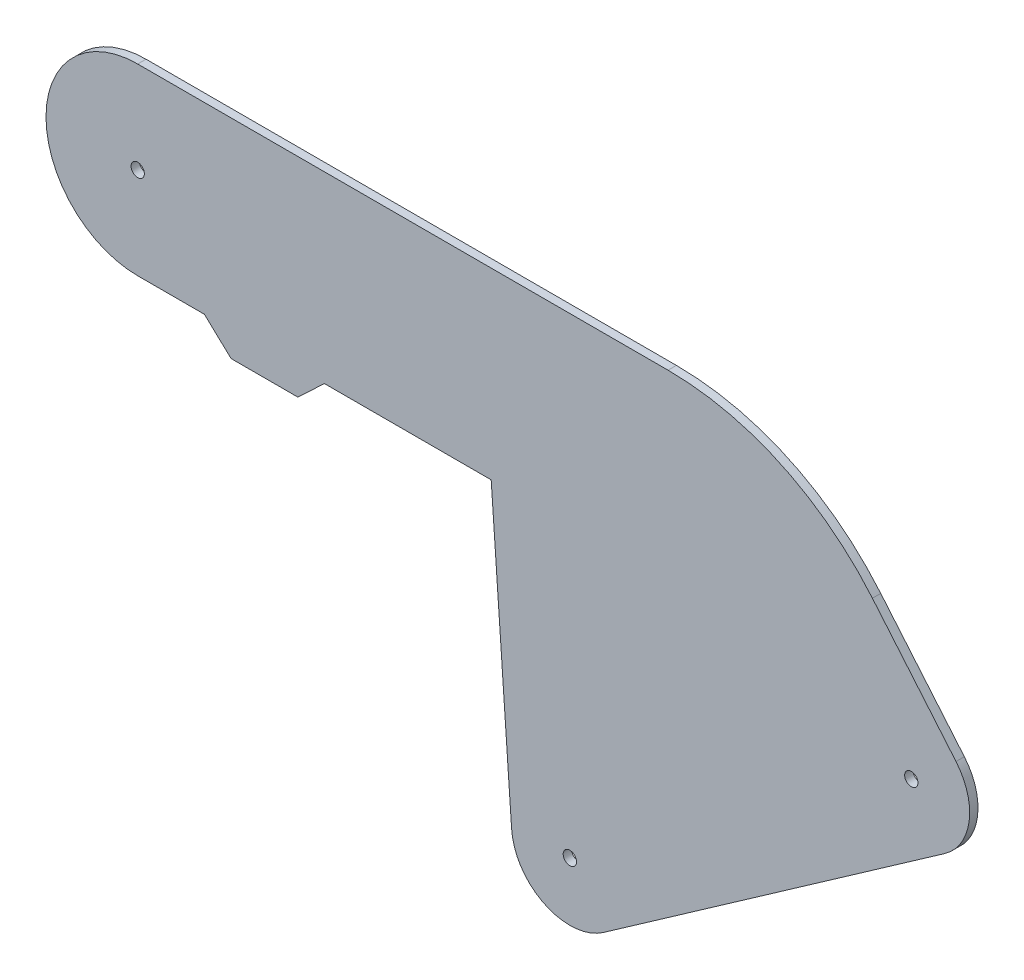
ISO-10303-21;
HEADER;
FILE_DESCRIPTION(('STEP AP214'),'2;1');
FILE_NAME('part.step','',(''),(''),'','','');
FILE_SCHEMA(('AUTOMOTIVE_DESIGN { 1 0 10303 214 1 1 1 1 }'));
ENDSEC;
DATA;
#1=APPLICATION_CONTEXT('core data for automotive mechanical design processes');
#2=APPLICATION_PROTOCOL_DEFINITION('international standard','automotive_design',2000,#1);
#3=PRODUCT_CONTEXT('',#1,'mechanical');
#4=PRODUCT('Part','Part','',(#3));
#5=PRODUCT_RELATED_PRODUCT_CATEGORY('part','',(#4));
#6=PRODUCT_DEFINITION_FORMATION('','',#4);
#7=PRODUCT_DEFINITION_CONTEXT('part definition',#1,'design');
#8=PRODUCT_DEFINITION('design','',#6,#7);
#9=PRODUCT_DEFINITION_SHAPE('','',#8);
#10=(LENGTH_UNIT() NAMED_UNIT(*) SI_UNIT(.MILLI.,.METRE.));
#11=(NAMED_UNIT(*) PLANE_ANGLE_UNIT() SI_UNIT($,.RADIAN.));
#12=(NAMED_UNIT(*) SI_UNIT($,.STERADIAN.) SOLID_ANGLE_UNIT());
#13=UNCERTAINTY_MEASURE_WITH_UNIT(LENGTH_MEASURE(1.E-05),#10,'distance_accuracy_value','');
#14=(GEOMETRIC_REPRESENTATION_CONTEXT(3) GLOBAL_UNCERTAINTY_ASSIGNED_CONTEXT((#13)) GLOBAL_UNIT_ASSIGNED_CONTEXT((#10,
#11,#12)) REPRESENTATION_CONTEXT('',''));
#15=CARTESIAN_POINT('',(0.,0.,0.));
#16=DIRECTION('',(0.,0.,1.));
#17=DIRECTION('',(1.,0.,0.));
#18=AXIS2_PLACEMENT_3D('',#15,#16,#17);
#19=CARTESIAN_POINT('',(164.572072720799,71.2488259804572,3.175));
#20=DIRECTION('',(0.,0.,1.));
#21=DIRECTION('',(1.,0.,0.));
#22=AXIS2_PLACEMENT_3D('',#19,#20,#21);
#23=PLANE('',#22);
#24=CARTESIAN_POINT('',(0.,215.9,3.175));
#25=DIRECTION('',(0.,0.,1.));
#26=DIRECTION('',(1.,0.,0.));
#27=AXIS2_PLACEMENT_3D('',#24,#25,#26);
#28=CIRCLE('',#27,2.54000000000001);
#29=CARTESIAN_POINT('',(2.54000000000001,215.9,3.175));
#30=VERTEX_POINT('',#29);
#31=EDGE_CURVE('E349',#30,#30,#28,.T.);
#32=ORIENTED_EDGE('',*,*,#31,.F.);
#33=EDGE_LOOP('',(#32));
#34=FACE_BOUND('',#33,.T.);
#35=CARTESIAN_POINT('',(164.572072720799,71.2488259804572,3.175));
#36=DIRECTION('',(0.,0.,1.));
#37=DIRECTION('',(1.,0.,0.));
#38=AXIS2_PLACEMENT_3D('',#35,#36,#37);
#39=CIRCLE('',#38,22.2249999999999);
#40=CARTESIAN_POINT('',(142.401211703775,69.6984883514941,3.175));
#41=VERTEX_POINT('',#40);
#42=CARTESIAN_POINT('',(177.319809018701,53.0431717961344,3.175));
#43=VERTEX_POINT('',#42);
#44=EDGE_CURVE('E215',#41,#43,#39,.T.);
#45=ORIENTED_EDGE('',*,*,#44,.T.);
#46=DIRECTION('',(0.819152044288991,0.573576436351047,0.));
#47=VECTOR('',#46,1.);
#48=CARTESIAN_POINT('',(177.319809018701,53.0431717961344,3.175));
#49=LINE('',#48,#47);
#50=CARTESIAN_POINT('',(307.360196049579,144.098431066863,3.175));
#51=VERTEX_POINT('',#50);
#52=EDGE_CURVE('E121',#43,#51,#49,.T.);
#53=ORIENTED_EDGE('',*,*,#52,.T.);
#54=CARTESIAN_POINT('',(294.612459751677,162.304085251186,3.175));
#55=DIRECTION('',(0.,0.,1.));
#56=DIRECTION('',(-1.,0.,0.));
#57=AXIS2_PLACEMENT_3D('',#54,#55,#56);
#58=CIRCLE('',#57,22.225);
#59=CARTESIAN_POINT('',(311.637797499996,176.590039876469,3.175));
#60=VERTEX_POINT('',#59);
#61=EDGE_CURVE('E256',#51,#60,#58,.T.);
#62=ORIENTED_EDGE('',*,*,#61,.T.);
#63=DIRECTION('',(-0.642787609686537,0.76604444311898,0.));
#64=VECTOR('',#63,1.);
#65=CARTESIAN_POINT('',(279.800527192222,214.532221144152,3.175));
#66=LINE('',#65,#64);
#67=CARTESIAN_POINT('',(279.800527192222,214.532221144152,3.175));
#68=VERTEX_POINT('',#67);
#69=EDGE_CURVE('E276',#60,#68,#66,.T.);
#70=ORIENTED_EDGE('',*,*,#69,.T.);
#71=CARTESIAN_POINT('',(201.970411771333,149.225,3.175));
#72=DIRECTION('',(0.,0.,1.));
#73=DIRECTION('',(-1.,0.,0.));
#74=AXIS2_PLACEMENT_3D('',#71,#72,#73);
#75=CIRCLE('',#74,101.6);
#76=CARTESIAN_POINT('',(201.970411771333,250.825,3.175));
#77=VERTEX_POINT('',#76);
#78=EDGE_CURVE('E272',#68,#77,#75,.T.);
#79=ORIENTED_EDGE('',*,*,#78,.T.);
#80=DIRECTION('',(-1.,0.,0.));
#81=VECTOR('',#80,1.);
#82=CARTESIAN_POINT('',(0.,250.825,3.175));
#83=LINE('',#82,#81);
#84=CARTESIAN_POINT('',(0.,250.825,3.175));
#85=VERTEX_POINT('',#84);
#86=EDGE_CURVE('E275',#77,#85,#83,.T.);
#87=ORIENTED_EDGE('',*,*,#86,.T.);
#88=CARTESIAN_POINT('',(0.,215.9,3.175));
#89=DIRECTION('',(0.,0.,1.));
#90=DIRECTION('',(1.,0.,0.));
#91=AXIS2_PLACEMENT_3D('',#88,#89,#90);
#92=CIRCLE('',#91,34.925);
#93=CARTESIAN_POINT('',(0.,180.975,3.175));
#94=VERTEX_POINT('',#93);
#95=EDGE_CURVE('E280',#85,#94,#92,.T.);
#96=ORIENTED_EDGE('',*,*,#95,.T.);
#97=DIRECTION('',(1.,0.,0.));
#98=VECTOR('',#97,1.);
#99=CARTESIAN_POINT('',(0.,180.975,3.175));
#100=LINE('',#99,#98);
#101=CARTESIAN_POINT('',(25.4,180.975,3.175));
#102=VERTEX_POINT('',#101);
#103=EDGE_CURVE('E287',#94,#102,#100,.T.);
#104=ORIENTED_EDGE('',*,*,#103,.T.);
#105=DIRECTION('',(0.729537204140084,-0.683941128881331,0.));
#106=VECTOR('',#105,1.);
#107=CARTESIAN_POINT('',(25.4,180.975,3.175));
#108=LINE('',#107,#106);
#109=CARTESIAN_POINT('',(35.56,171.45,3.175));
#110=VERTEX_POINT('',#109);
#111=EDGE_CURVE('E290',#102,#110,#108,.T.);
#112=ORIENTED_EDGE('',*,*,#111,.T.);
#113=DIRECTION('',(1.,0.,0.));
#114=VECTOR('',#113,1.);
#115=CARTESIAN_POINT('',(35.56,171.45,3.175));
#116=LINE('',#115,#114);
#117=CARTESIAN_POINT('',(60.96,171.45,3.175));
#118=VERTEX_POINT('',#117);
#119=EDGE_CURVE('E155',#110,#118,#116,.T.);
#120=ORIENTED_EDGE('',*,*,#119,.T.);
#121=DIRECTION('',(0.729537204140085,0.68394112888133,0.));
#122=VECTOR('',#121,1.);
#123=CARTESIAN_POINT('',(60.96,171.45,3.175));
#124=LINE('',#123,#122);
#125=CARTESIAN_POINT('',(71.12,180.975,3.175));
#126=VERTEX_POINT('',#125);
#127=EDGE_CURVE('E149',#118,#126,#124,.T.);
#128=ORIENTED_EDGE('',*,*,#127,.T.);
#129=DIRECTION('',(1.,0.,0.));
#130=VECTOR('',#129,1.);
#131=CARTESIAN_POINT('',(71.12,180.975,3.175));
#132=LINE('',#131,#130);
#133=CARTESIAN_POINT('',(134.62,180.975,3.175));
#134=VERTEX_POINT('',#133);
#135=EDGE_CURVE('E153',#126,#134,#132,.T.);
#136=ORIENTED_EDGE('',*,*,#135,.T.);
#137=DIRECTION('',(0.069756473744122,-0.997564050259824,0.));
#138=VECTOR('',#137,1.);
#139=CARTESIAN_POINT('',(134.62,180.975,3.175));
#140=LINE('',#139,#138);
#141=EDGE_CURVE('E63',#134,#41,#140,.T.);
#142=ORIENTED_EDGE('',*,*,#141,.T.);
#143=EDGE_LOOP('',(#45,#53,#62,#70,#79,#87,#96,#104,#112,#120,#128,#136,#142));
#144=FACE_BOUND('',#143,.T.);
#145=CARTESIAN_POINT('',(164.572072720799,71.2488259804572,3.175));
#146=DIRECTION('',(0.,0.,1.));
#147=DIRECTION('',(1.,0.,0.));
#148=AXIS2_PLACEMENT_3D('',#145,#146,#147);
#149=CIRCLE('',#148,2.5400000000398);
#150=CARTESIAN_POINT('',(167.112072720839,71.2488259804572,3.175));
#151=VERTEX_POINT('',#150);
#152=EDGE_CURVE('E182',#151,#151,#149,.T.);
#153=ORIENTED_EDGE('',*,*,#152,.F.);
#154=EDGE_LOOP('',(#153));
#155=FACE_BOUND('',#154,.T.);
#156=CARTESIAN_POINT('',(294.612459751677,162.304085251186,3.175));
#157=DIRECTION('',(0.,0.,1.));
#158=DIRECTION('',(1.,0.,0.));
#159=AXIS2_PLACEMENT_3D('',#156,#157,#158);
#160=CIRCLE('',#159,2.54000000000186);
#161=CARTESIAN_POINT('',(297.152459751678,162.304085251186,3.175));
#162=VERTEX_POINT('',#161);
#163=EDGE_CURVE('E338',#162,#162,#160,.T.);
#164=ORIENTED_EDGE('',*,*,#163,.F.);
#165=EDGE_LOOP('',(#164));
#166=FACE_BOUND('',#165,.T.);
#167=ADVANCED_FACE('F45',(#34,#144,#155,#166),#23,.T.);
#168=CARTESIAN_POINT('',(164.572072720799,71.2488259804572,0.));
#169=DIRECTION('',(0.,0.,1.));
#170=DIRECTION('',(1.,0.,0.));
#171=AXIS2_PLACEMENT_3D('',#168,#169,#170);
#172=PLANE('',#171);
#173=CARTESIAN_POINT('',(164.572072720799,71.2488259804572,0.));
#174=DIRECTION('',(0.,0.,1.));
#175=DIRECTION('',(1.,0.,0.));
#176=AXIS2_PLACEMENT_3D('',#173,#174,#175);
#177=CIRCLE('',#176,22.2249999999999);
#178=CARTESIAN_POINT('',(142.401211703775,69.6984883514941,0.));
#179=VERTEX_POINT('',#178);
#180=CARTESIAN_POINT('',(177.319809018701,53.0431717961344,0.));
#181=VERTEX_POINT('',#180);
#182=EDGE_CURVE('E177',#179,#181,#177,.T.);
#183=ORIENTED_EDGE('',*,*,#182,.F.);
#184=DIRECTION('',(0.069756473744122,-0.997564050259824,0.));
#185=VECTOR('',#184,1.);
#186=CARTESIAN_POINT('',(134.62,180.975,0.));
#187=LINE('',#186,#185);
#188=CARTESIAN_POINT('',(134.62,180.975,0.));
#189=VERTEX_POINT('',#188);
#190=EDGE_CURVE('E113',#189,#179,#187,.T.);
#191=ORIENTED_EDGE('',*,*,#190,.F.);
#192=DIRECTION('',(1.,0.,0.));
#193=VECTOR('',#192,1.);
#194=CARTESIAN_POINT('',(71.12,180.975,0.));
#195=LINE('',#194,#193);
#196=CARTESIAN_POINT('',(71.12,180.975,0.));
#197=VERTEX_POINT('',#196);
#198=EDGE_CURVE('E107',#197,#189,#195,.T.);
#199=ORIENTED_EDGE('',*,*,#198,.F.);
#200=DIRECTION('',(0.729537204140085,0.68394112888133,0.));
#201=VECTOR('',#200,1.);
#202=CARTESIAN_POINT('',(60.96,171.45,0.));
#203=LINE('',#202,#201);
#204=CARTESIAN_POINT('',(60.96,171.45,0.));
#205=VERTEX_POINT('',#204);
#206=EDGE_CURVE('E164',#205,#197,#203,.T.);
#207=ORIENTED_EDGE('',*,*,#206,.F.);
#208=DIRECTION('',(1.,0.,0.));
#209=VECTOR('',#208,1.);
#210=CARTESIAN_POINT('',(35.56,171.45,0.));
#211=LINE('',#210,#209);
#212=CARTESIAN_POINT('',(35.56,171.45,0.));
#213=VERTEX_POINT('',#212);
#214=EDGE_CURVE('E206',#213,#205,#211,.T.);
#215=ORIENTED_EDGE('',*,*,#214,.F.);
#216=DIRECTION('',(0.729537204140084,-0.683941128881331,0.));
#217=VECTOR('',#216,1.);
#218=CARTESIAN_POINT('',(25.4,180.975,0.));
#219=LINE('',#218,#217);
#220=CARTESIAN_POINT('',(25.4,180.975,0.));
#221=VERTEX_POINT('',#220);
#222=EDGE_CURVE('E203',#221,#213,#219,.T.);
#223=ORIENTED_EDGE('',*,*,#222,.F.);
#224=DIRECTION('',(1.,0.,0.));
#225=VECTOR('',#224,1.);
#226=CARTESIAN_POINT('',(0.,180.975,0.));
#227=LINE('',#226,#225);
#228=CARTESIAN_POINT('',(0.,180.975,0.));
#229=VERTEX_POINT('',#228);
#230=EDGE_CURVE('E200',#229,#221,#227,.T.);
#231=ORIENTED_EDGE('',*,*,#230,.F.);
#232=CARTESIAN_POINT('',(0.,215.9,0.));
#233=DIRECTION('',(0.,0.,1.));
#234=DIRECTION('',(1.,0.,0.));
#235=AXIS2_PLACEMENT_3D('',#232,#233,#234);
#236=CIRCLE('',#235,34.925);
#237=CARTESIAN_POINT('',(0.,250.825,0.));
#238=VERTEX_POINT('',#237);
#239=EDGE_CURVE('E197',#238,#229,#236,.T.);
#240=ORIENTED_EDGE('',*,*,#239,.F.);
#241=DIRECTION('',(-1.,0.,0.));
#242=VECTOR('',#241,1.);
#243=CARTESIAN_POINT('',(0.,250.825,0.));
#244=LINE('',#243,#242);
#245=CARTESIAN_POINT('',(201.970411771333,250.825,0.));
#246=VERTEX_POINT('',#245);
#247=EDGE_CURVE('E194',#246,#238,#244,.T.);
#248=ORIENTED_EDGE('',*,*,#247,.F.);
#249=CARTESIAN_POINT('',(201.970411771333,149.225,0.));
#250=DIRECTION('',(0.,0.,1.));
#251=DIRECTION('',(-1.,0.,0.));
#252=AXIS2_PLACEMENT_3D('',#249,#250,#251);
#253=CIRCLE('',#252,101.6);
#254=CARTESIAN_POINT('',(279.800527192222,214.532221144152,0.));
#255=VERTEX_POINT('',#254);
#256=EDGE_CURVE('E191',#255,#246,#253,.T.);
#257=ORIENTED_EDGE('',*,*,#256,.F.);
#258=DIRECTION('',(-0.642787609686537,0.76604444311898,0.));
#259=VECTOR('',#258,1.);
#260=CARTESIAN_POINT('',(279.800527192222,214.532221144152,0.));
#261=LINE('',#260,#259);
#262=CARTESIAN_POINT('',(311.637797499996,176.590039876469,0.));
#263=VERTEX_POINT('',#262);
#264=EDGE_CURVE('E188',#263,#255,#261,.T.);
#265=ORIENTED_EDGE('',*,*,#264,.F.);
#266=CARTESIAN_POINT('',(294.612459751677,162.304085251186,0.));
#267=DIRECTION('',(0.,0.,1.));
#268=DIRECTION('',(-1.,0.,0.));
#269=AXIS2_PLACEMENT_3D('',#266,#267,#268);
#270=CIRCLE('',#269,22.225);
#271=CARTESIAN_POINT('',(307.360196049579,144.098431066863,0.));
#272=VERTEX_POINT('',#271);
#273=EDGE_CURVE('E185',#272,#263,#270,.T.);
#274=ORIENTED_EDGE('',*,*,#273,.F.);
#275=DIRECTION('',(0.819152044288991,0.573576436351047,0.));
#276=VECTOR('',#275,1.);
#277=CARTESIAN_POINT('',(177.319809018701,53.0431717961344,0.));
#278=LINE('',#277,#276);
#279=EDGE_CURVE('E181',#181,#272,#278,.T.);
#280=ORIENTED_EDGE('',*,*,#279,.F.);
#281=EDGE_LOOP('',(#183,#191,#199,#207,#215,#223,#231,#240,#248,#257,#265,#274,#280));
#282=FACE_BOUND('',#281,.T.);
#283=CARTESIAN_POINT('',(164.572072720799,71.2488259804572,0.));
#284=DIRECTION('',(0.,0.,1.));
#285=DIRECTION('',(1.,0.,0.));
#286=AXIS2_PLACEMENT_3D('',#283,#284,#285);
#287=CIRCLE('',#286,2.5400000000398);
#288=CARTESIAN_POINT('',(167.112072720839,71.2488259804572,0.));
#289=VERTEX_POINT('',#288);
#290=EDGE_CURVE('E353',#289,#289,#287,.T.);
#291=ORIENTED_EDGE('',*,*,#290,.T.);
#292=EDGE_LOOP('',(#291));
#293=FACE_BOUND('',#292,.T.);
#294=CARTESIAN_POINT('',(0.,215.9,0.));
#295=DIRECTION('',(0.,0.,1.));
#296=DIRECTION('',(1.,0.,0.));
#297=AXIS2_PLACEMENT_3D('',#294,#295,#296);
#298=CIRCLE('',#297,2.54000000000001);
#299=CARTESIAN_POINT('',(2.54000000000001,215.9,0.));
#300=VERTEX_POINT('',#299);
#301=EDGE_CURVE('E346',#300,#300,#298,.T.);
#302=ORIENTED_EDGE('',*,*,#301,.T.);
#303=EDGE_LOOP('',(#302));
#304=FACE_BOUND('',#303,.T.);
#305=CARTESIAN_POINT('',(294.612459751677,162.304085251186,0.));
#306=DIRECTION('',(0.,0.,1.));
#307=DIRECTION('',(1.,0.,0.));
#308=AXIS2_PLACEMENT_3D('',#305,#306,#307);
#309=CIRCLE('',#308,2.54000000000186);
#310=CARTESIAN_POINT('',(297.152459751678,162.304085251186,0.));
#311=VERTEX_POINT('',#310);
#312=EDGE_CURVE('E341',#311,#311,#309,.T.);
#313=ORIENTED_EDGE('',*,*,#312,.T.);
#314=EDGE_LOOP('',(#313));
#315=FACE_BOUND('',#314,.T.);
#316=ADVANCED_FACE('F260',(#282,#293,#304,#315),#172,.F.);
#317=CARTESIAN_POINT('',(164.572072720799,71.2488259804572,3.175));
#318=DIRECTION('',(0.,0.,-1.));
#319=DIRECTION('',(-1.,0.,0.));
#320=AXIS2_PLACEMENT_3D('',#317,#318,#319);
#321=CYLINDRICAL_SURFACE('',#320,22.2249999999999);
#322=ORIENTED_EDGE('',*,*,#182,.T.);
#323=DIRECTION('',(0.,0.,-1.));
#324=VECTOR('',#323,1.);
#325=CARTESIAN_POINT('',(177.319809018701,53.0431717961344,3.175));
#326=LINE('',#325,#324);
#327=EDGE_CURVE('E11',#43,#181,#326,.T.);
#328=ORIENTED_EDGE('',*,*,#327,.F.);
#329=ORIENTED_EDGE('',*,*,#44,.F.);
#330=DIRECTION('',(0.,0.,-1.));
#331=VECTOR('',#330,1.);
#332=CARTESIAN_POINT('',(142.401211703775,69.6984883514941,3.175));
#333=LINE('',#332,#331);
#334=EDGE_CURVE('E173',#41,#179,#333,.T.);
#335=ORIENTED_EDGE('',*,*,#334,.T.);
#336=EDGE_LOOP('',(#322,#328,#329,#335));
#337=FACE_BOUND('',#336,.T.);
#338=ADVANCED_FACE('F47',(#337),#321,.T.);
#339=CARTESIAN_POINT('',(177.319809018701,53.0431717961344,3.175));
#340=DIRECTION('',(-0.573576436351047,0.819152044288991,0.));
#341=DIRECTION('',(-0.819152044288992,-0.573576436351047,0.));
#342=AXIS2_PLACEMENT_3D('',#339,#340,#341);
#343=PLANE('',#342);
#344=ORIENTED_EDGE('',*,*,#279,.T.);
#345=DIRECTION('',(0.,0.,-1.));
#346=VECTOR('',#345,1.);
#347=CARTESIAN_POINT('',(307.360196049579,144.098431066863,3.175));
#348=LINE('',#347,#346);
#349=EDGE_CURVE('E55',#51,#272,#348,.T.);
#350=ORIENTED_EDGE('',*,*,#349,.F.);
#351=ORIENTED_EDGE('',*,*,#52,.F.);
#352=ORIENTED_EDGE('',*,*,#327,.T.);
#353=EDGE_LOOP('',(#344,#350,#351,#352));
#354=FACE_BOUND('',#353,.T.);
#355=ADVANCED_FACE('F474',(#354),#343,.F.);
#356=CARTESIAN_POINT('',(294.612459751677,162.304085251186,3.175));
#357=DIRECTION('',(0.,0.,-1.));
#358=DIRECTION('',(-1.,0.,0.));
#359=AXIS2_PLACEMENT_3D('',#356,#357,#358);
#360=CYLINDRICAL_SURFACE('',#359,22.225);
#361=ORIENTED_EDGE('',*,*,#273,.T.);
#362=DIRECTION('',(0.,0.,-1.));
#363=VECTOR('',#362,1.);
#364=CARTESIAN_POINT('',(311.637797499996,176.590039876469,3.175));
#365=LINE('',#364,#363);
#366=EDGE_CURVE('E246',#60,#263,#365,.T.);
#367=ORIENTED_EDGE('',*,*,#366,.F.);
#368=ORIENTED_EDGE('',*,*,#61,.F.);
#369=ORIENTED_EDGE('',*,*,#349,.T.);
#370=EDGE_LOOP('',(#361,#367,#368,#369));
#371=FACE_BOUND('',#370,.T.);
#372=ADVANCED_FACE('F254',(#371),#360,.T.);
#373=CARTESIAN_POINT('',(279.800527192222,214.532221144152,3.175));
#374=DIRECTION('',(-0.76604444311898,-0.642787609686537,0.));
#375=DIRECTION('',(0.642787609686537,-0.76604444311898,0.));
#376=AXIS2_PLACEMENT_3D('',#373,#374,#375);
#377=PLANE('',#376);
#378=ORIENTED_EDGE('',*,*,#264,.T.);
#379=DIRECTION('',(0.,0.,-1.));
#380=VECTOR('',#379,1.);
#381=CARTESIAN_POINT('',(279.800527192222,214.532221144152,3.175));
#382=LINE('',#381,#380);
#383=EDGE_CURVE('E242',#68,#255,#382,.T.);
#384=ORIENTED_EDGE('',*,*,#383,.F.);
#385=ORIENTED_EDGE('',*,*,#69,.F.);
#386=ORIENTED_EDGE('',*,*,#366,.T.);
#387=EDGE_LOOP('',(#378,#384,#385,#386));
#388=FACE_BOUND('',#387,.T.);
#389=ADVANCED_FACE('F266',(#388),#377,.F.);
#390=CARTESIAN_POINT('',(201.970411771333,149.225,3.175));
#391=DIRECTION('',(0.,0.,-1.));
#392=DIRECTION('',(-1.,0.,0.));
#393=AXIS2_PLACEMENT_3D('',#390,#391,#392);
#394=CYLINDRICAL_SURFACE('',#393,101.6);
#395=ORIENTED_EDGE('',*,*,#256,.T.);
#396=DIRECTION('',(0.,0.,-1.));
#397=VECTOR('',#396,1.);
#398=CARTESIAN_POINT('',(201.970411771333,250.825,3.175));
#399=LINE('',#398,#397);
#400=EDGE_CURVE('E238',#77,#246,#399,.T.);
#401=ORIENTED_EDGE('',*,*,#400,.F.);
#402=ORIENTED_EDGE('',*,*,#78,.F.);
#403=ORIENTED_EDGE('',*,*,#383,.T.);
#404=EDGE_LOOP('',(#395,#401,#402,#403));
#405=FACE_BOUND('',#404,.T.);
#406=ADVANCED_FACE('F270',(#405),#394,.T.);
#407=CARTESIAN_POINT('',(0.,250.825,3.175));
#408=DIRECTION('',(0.,-1.,0.));
#409=DIRECTION('',(1.,0.,0.));
#410=AXIS2_PLACEMENT_3D('',#407,#408,#409);
#411=PLANE('',#410);
#412=ORIENTED_EDGE('',*,*,#247,.T.);
#413=DIRECTION('',(0.,0.,-1.));
#414=VECTOR('',#413,1.);
#415=CARTESIAN_POINT('',(0.,250.825,3.175));
#416=LINE('',#415,#414);
#417=EDGE_CURVE('E234',#85,#238,#416,.T.);
#418=ORIENTED_EDGE('',*,*,#417,.F.);
#419=ORIENTED_EDGE('',*,*,#86,.F.);
#420=ORIENTED_EDGE('',*,*,#400,.T.);
#421=EDGE_LOOP('',(#412,#418,#419,#420));
#422=FACE_BOUND('',#421,.T.);
#423=ADVANCED_FACE('F439',(#422),#411,.F.);
#424=CARTESIAN_POINT('',(0.,215.9,3.175));
#425=DIRECTION('',(0.,0.,-1.));
#426=DIRECTION('',(-1.,0.,0.));
#427=AXIS2_PLACEMENT_3D('',#424,#425,#426);
#428=CYLINDRICAL_SURFACE('',#427,34.925);
#429=ORIENTED_EDGE('',*,*,#239,.T.);
#430=DIRECTION('',(0.,0.,-1.));
#431=VECTOR('',#430,1.);
#432=CARTESIAN_POINT('',(0.,180.975,3.175));
#433=LINE('',#432,#431);
#434=EDGE_CURVE('E230',#94,#229,#433,.T.);
#435=ORIENTED_EDGE('',*,*,#434,.F.);
#436=ORIENTED_EDGE('',*,*,#95,.F.);
#437=ORIENTED_EDGE('',*,*,#417,.T.);
#438=EDGE_LOOP('',(#429,#435,#436,#437));
#439=FACE_BOUND('',#438,.T.);
#440=ADVANCED_FACE('F429',(#439),#428,.T.);
#441=CARTESIAN_POINT('',(0.,180.975,3.175));
#442=DIRECTION('',(0.,1.,0.));
#443=DIRECTION('',(0.,0.,1.));
#444=AXIS2_PLACEMENT_3D('',#441,#442,#443);
#445=PLANE('',#444);
#446=ORIENTED_EDGE('',*,*,#230,.T.);
#447=DIRECTION('',(0.,0.,-1.));
#448=VECTOR('',#447,1.);
#449=CARTESIAN_POINT('',(25.4,180.975,3.175));
#450=LINE('',#449,#448);
#451=EDGE_CURVE('E226',#102,#221,#450,.T.);
#452=ORIENTED_EDGE('',*,*,#451,.F.);
#453=ORIENTED_EDGE('',*,*,#103,.F.);
#454=ORIENTED_EDGE('',*,*,#434,.T.);
#455=EDGE_LOOP('',(#446,#452,#453,#454));
#456=FACE_BOUND('',#455,.T.);
#457=ADVANCED_FACE('F420',(#456),#445,.F.);
#458=CARTESIAN_POINT('',(25.4,180.975,3.175));
#459=DIRECTION('',(0.683941128881331,0.729537204140084,0.));
#460=DIRECTION('',(-0.729537204140084,0.683941128881331,0.));
#461=AXIS2_PLACEMENT_3D('',#458,#459,#460);
#462=PLANE('',#461);
#463=ORIENTED_EDGE('',*,*,#222,.T.);
#464=DIRECTION('',(0.,0.,-1.));
#465=VECTOR('',#464,1.);
#466=CARTESIAN_POINT('',(35.56,171.45,3.175));
#467=LINE('',#466,#465);
#468=EDGE_CURVE('E222',#110,#213,#467,.T.);
#469=ORIENTED_EDGE('',*,*,#468,.F.);
#470=ORIENTED_EDGE('',*,*,#111,.F.);
#471=ORIENTED_EDGE('',*,*,#451,.T.);
#472=EDGE_LOOP('',(#463,#469,#470,#471));
#473=FACE_BOUND('',#472,.T.);
#474=ADVANCED_FACE('F298',(#473),#462,.F.);
#475=CARTESIAN_POINT('',(35.56,171.45,3.175));
#476=DIRECTION('',(0.,1.,0.));
#477=DIRECTION('',(0.,0.,1.));
#478=AXIS2_PLACEMENT_3D('',#475,#476,#477);
#479=PLANE('',#478);
#480=ORIENTED_EDGE('',*,*,#214,.T.);
#481=DIRECTION('',(0.,0.,-1.));
#482=VECTOR('',#481,1.);
#483=CARTESIAN_POINT('',(60.96,171.45,3.175));
#484=LINE('',#483,#482);
#485=EDGE_CURVE('E166',#118,#205,#484,.T.);
#486=ORIENTED_EDGE('',*,*,#485,.F.);
#487=ORIENTED_EDGE('',*,*,#119,.F.);
#488=ORIENTED_EDGE('',*,*,#468,.T.);
#489=EDGE_LOOP('',(#480,#486,#487,#488));
#490=FACE_BOUND('',#489,.T.);
#491=ADVANCED_FACE('F302',(#490),#479,.F.);
#492=CARTESIAN_POINT('',(60.96,171.45,3.175));
#493=DIRECTION('',(-0.68394112888133,0.729537204140085,0.));
#494=DIRECTION('',(-0.729537204140085,-0.68394112888133,0.));
#495=AXIS2_PLACEMENT_3D('',#492,#493,#494);
#496=PLANE('',#495);
#497=ORIENTED_EDGE('',*,*,#206,.T.);
#498=DIRECTION('',(0.,0.,-1.));
#499=VECTOR('',#498,1.);
#500=CARTESIAN_POINT('',(71.12,180.975,3.175));
#501=LINE('',#500,#499);
#502=EDGE_CURVE('E161',#126,#197,#501,.T.);
#503=ORIENTED_EDGE('',*,*,#502,.F.);
#504=ORIENTED_EDGE('',*,*,#127,.F.);
#505=ORIENTED_EDGE('',*,*,#485,.T.);
#506=EDGE_LOOP('',(#497,#503,#504,#505));
#507=FACE_BOUND('',#506,.T.);
#508=ADVANCED_FACE('F162',(#507),#496,.F.);
#509=CARTESIAN_POINT('',(71.12,180.975,3.175));
#510=DIRECTION('',(0.,1.,0.));
#511=DIRECTION('',(-1.,0.,0.));
#512=AXIS2_PLACEMENT_3D('',#509,#510,#511);
#513=PLANE('',#512);
#514=ORIENTED_EDGE('',*,*,#198,.T.);
#515=DIRECTION('',(0.,0.,-1.));
#516=VECTOR('',#515,1.);
#517=CARTESIAN_POINT('',(134.62,180.975,3.175));
#518=LINE('',#517,#516);
#519=EDGE_CURVE('E167',#134,#189,#518,.T.);
#520=ORIENTED_EDGE('',*,*,#519,.F.);
#521=ORIENTED_EDGE('',*,*,#135,.F.);
#522=ORIENTED_EDGE('',*,*,#502,.T.);
#523=EDGE_LOOP('',(#514,#520,#521,#522));
#524=FACE_BOUND('',#523,.T.);
#525=ADVANCED_FACE('F169',(#524),#513,.F.);
#526=CARTESIAN_POINT('',(134.62,180.975,3.175));
#527=DIRECTION('',(0.997564050259824,0.069756473744122,0.));
#528=DIRECTION('',(-0.069756473744122,0.997564050259825,0.));
#529=AXIS2_PLACEMENT_3D('',#526,#527,#528);
#530=PLANE('',#529);
#531=ORIENTED_EDGE('',*,*,#190,.T.);
#532=ORIENTED_EDGE('',*,*,#334,.F.);
#533=ORIENTED_EDGE('',*,*,#141,.F.);
#534=ORIENTED_EDGE('',*,*,#519,.T.);
#535=EDGE_LOOP('',(#531,#532,#533,#534));
#536=FACE_BOUND('',#535,.T.);
#537=ADVANCED_FACE('F306',(#536),#530,.F.);
#538=CARTESIAN_POINT('',(164.572072720799,71.2488259804572,3.175));
#539=DIRECTION('',(0.,0.,-1.));
#540=DIRECTION('',(-1.,0.,0.));
#541=AXIS2_PLACEMENT_3D('',#538,#539,#540);
#542=CYLINDRICAL_SURFACE('',#541,2.5400000000398);
#543=ORIENTED_EDGE('',*,*,#152,.T.);
#544=EDGE_LOOP('',(#543));
#545=FACE_BOUND('',#544,.T.);
#546=ORIENTED_EDGE('',*,*,#290,.F.);
#547=EDGE_LOOP('',(#546));
#548=FACE_BOUND('',#547,.T.);
#549=ADVANCED_FACE('F308',(#545,#548),#542,.F.);
#550=CARTESIAN_POINT('',(0.,215.9,3.175));
#551=DIRECTION('',(0.,0.,-1.));
#552=DIRECTION('',(-1.,0.,0.));
#553=AXIS2_PLACEMENT_3D('',#550,#551,#552);
#554=CYLINDRICAL_SURFACE('',#553,2.54000000000001);
#555=ORIENTED_EDGE('',*,*,#31,.T.);
#556=EDGE_LOOP('',(#555));
#557=FACE_BOUND('',#556,.T.);
#558=ORIENTED_EDGE('',*,*,#301,.F.);
#559=EDGE_LOOP('',(#558));
#560=FACE_BOUND('',#559,.T.);
#561=ADVANCED_FACE('F314',(#557,#560),#554,.F.);
#562=CARTESIAN_POINT('',(294.612459751677,162.304085251186,3.175));
#563=DIRECTION('',(0.,0.,-1.));
#564=DIRECTION('',(-1.,0.,0.));
#565=AXIS2_PLACEMENT_3D('',#562,#563,#564);
#566=CYLINDRICAL_SURFACE('',#565,2.54000000000186);
#567=ORIENTED_EDGE('',*,*,#163,.T.);
#568=EDGE_LOOP('',(#567));
#569=FACE_BOUND('',#568,.T.);
#570=ORIENTED_EDGE('',*,*,#312,.F.);
#571=EDGE_LOOP('',(#570));
#572=FACE_BOUND('',#571,.T.);
#573=ADVANCED_FACE('F329',(#569,#572),#566,.F.);
#574=CLOSED_SHELL('',(#167,#316,#338,#355,#372,#389,#406,#423,#440,#457,#474,#491,#508,#525,
#537,#549,#561,#573));
#575=MANIFOLD_SOLID_BREP('B2',#574);
#576=ADVANCED_BREP_SHAPE_REPRESENTATION('',(#18,#575),#14);
#577=SHAPE_DEFINITION_REPRESENTATION(#9,#576);
ENDSEC;
END-ISO-10303-21;
